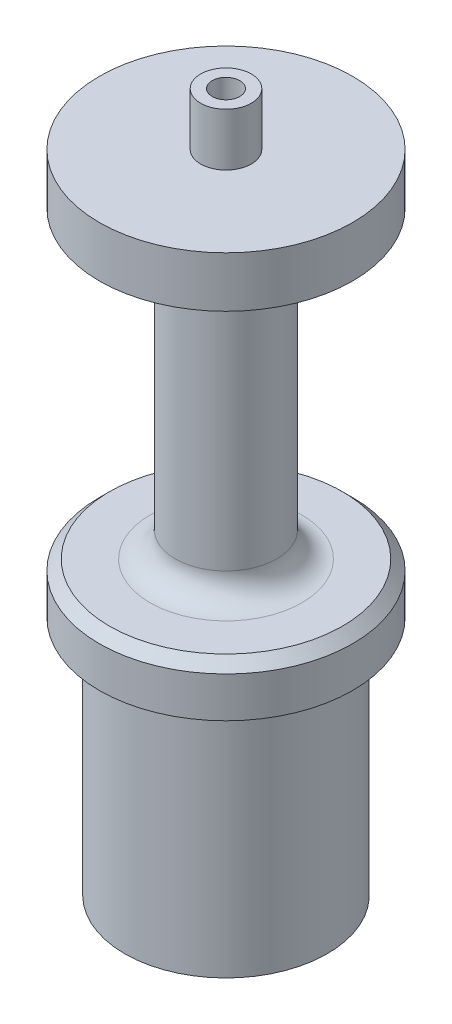
ISO-10303-21;
HEADER;
FILE_DESCRIPTION(('STEP AP214'),'2;1');
FILE_NAME('part.step','',(''),(''),'','','');
FILE_SCHEMA(('AUTOMOTIVE_DESIGN { 1 0 10303 214 1 1 1 1 }'));
ENDSEC;
DATA;
#1=APPLICATION_CONTEXT('core data for automotive mechanical design processes');
#2=APPLICATION_PROTOCOL_DEFINITION('international standard','automotive_design',2000,#1);
#3=PRODUCT_CONTEXT('',#1,'mechanical');
#4=PRODUCT('Part','Part','',(#3));
#5=PRODUCT_RELATED_PRODUCT_CATEGORY('part','',(#4));
#6=PRODUCT_DEFINITION_FORMATION('','',#4);
#7=PRODUCT_DEFINITION_CONTEXT('part definition',#1,'design');
#8=PRODUCT_DEFINITION('design','',#6,#7);
#9=PRODUCT_DEFINITION_SHAPE('','',#8);
#10=(LENGTH_UNIT() NAMED_UNIT(*) SI_UNIT(.MILLI.,.METRE.));
#11=(NAMED_UNIT(*) PLANE_ANGLE_UNIT() SI_UNIT($,.RADIAN.));
#12=(NAMED_UNIT(*) SI_UNIT($,.STERADIAN.) SOLID_ANGLE_UNIT());
#13=UNCERTAINTY_MEASURE_WITH_UNIT(LENGTH_MEASURE(1.E-05),#10,'distance_accuracy_value','');
#14=(GEOMETRIC_REPRESENTATION_CONTEXT(3) GLOBAL_UNCERTAINTY_ASSIGNED_CONTEXT((#13)) GLOBAL_UNIT_ASSIGNED_CONTEXT((#10,
#11,#12)) REPRESENTATION_CONTEXT('',''));
#15=CARTESIAN_POINT('',(0.,0.,0.));
#16=DIRECTION('',(0.,0.,1.));
#17=DIRECTION('',(1.,0.,0.));
#18=AXIS2_PLACEMENT_3D('',#15,#16,#17);
#19=CARTESIAN_POINT('',(0.,80.9625,0.));
#20=DIRECTION('',(0.,-1.,0.));
#21=DIRECTION('',(0.,0.,-1.));
#22=AXIS2_PLACEMENT_3D('',#19,#20,#21);
#23=CYLINDRICAL_SURFACE('',#22,15.875);
#24=CARTESIAN_POINT('',(0.,35.2425,0.));
#25=DIRECTION('',(0.,1.,0.));
#26=DIRECTION('',(0.,0.,1.));
#27=AXIS2_PLACEMENT_3D('',#24,#25,#26);
#28=CIRCLE('',#27,15.875);
#29=CARTESIAN_POINT('',(0.,35.2425,15.875));
#30=VERTEX_POINT('',#29);
#31=EDGE_CURVE('E11',#30,#30,#28,.F.);
#32=ORIENTED_EDGE('',*,*,#31,.T.);
#33=EDGE_LOOP('',(#32));
#34=FACE_BOUND('',#33,.T.);
#35=CARTESIAN_POINT('',(0.,30.1625,0.));
#36=DIRECTION('',(0.,1.,0.));
#37=DIRECTION('',(0.,0.,1.));
#38=AXIS2_PLACEMENT_3D('',#35,#36,#37);
#39=CIRCLE('',#38,15.875);
#40=CARTESIAN_POINT('',(0.,30.1625,15.875));
#41=VERTEX_POINT('',#40);
#42=EDGE_CURVE('E296',#41,#41,#39,.T.);
#43=ORIENTED_EDGE('',*,*,#42,.T.);
#44=EDGE_LOOP('',(#43));
#45=FACE_BOUND('',#44,.T.);
#46=ADVANCED_FACE('F34',(#34,#45),#23,.T.);
#47=CARTESIAN_POINT('',(0.,0.,0.));
#48=DIRECTION('',(0.,1.,0.));
#49=DIRECTION('',(0.,0.,1.));
#50=AXIS2_PLACEMENT_3D('',#47,#48,#49);
#51=PLANE('',#50);
#52=CARTESIAN_POINT('',(0.,0.,0.));
#53=DIRECTION('',(0.,1.,0.));
#54=DIRECTION('',(0.,0.,1.));
#55=AXIS2_PLACEMENT_3D('',#52,#53,#54);
#56=CIRCLE('',#55,12.7);
#57=CARTESIAN_POINT('',(0.,0.,12.7));
#58=VERTEX_POINT('',#57);
#59=EDGE_CURVE('E341',#58,#58,#56,.T.);
#60=ORIENTED_EDGE('',*,*,#59,.F.);
#61=EDGE_LOOP('',(#60));
#62=FACE_BOUND('',#61,.T.);
#63=DIRECTION('',(0.707106781186548,0.,0.707106781186547));
#64=VECTOR('',#63,1.);
#65=CARTESIAN_POINT('',(-4.94974746830584,0.,4.94974746830584));
#66=LINE('',#65,#64);
#67=CARTESIAN_POINT('',(-8.77696292147802,0.,1.12253201513365));
#68=VERTEX_POINT('',#67);
#69=CARTESIAN_POINT('',(-7.,0.,2.89949493661167));
#70=VERTEX_POINT('',#69);
#71=EDGE_CURVE('E49',#68,#70,#66,.T.);
#72=ORIENTED_EDGE('',*,*,#71,.T.);
#73=DIRECTION('',(0.,0.,1.));
#74=VECTOR('',#73,1.);
#75=CARTESIAN_POINT('',(-7.,0.,0.));
#76=LINE('',#75,#74);
#77=CARTESIAN_POINT('',(-7.,0.,5.4125));
#78=VERTEX_POINT('',#77);
#79=EDGE_CURVE('E135',#70,#78,#76,.T.);
#80=ORIENTED_EDGE('',*,*,#79,.T.);
#81=CARTESIAN_POINT('',(-5.4125,0.,5.4125));
#82=DIRECTION('',(0.,-1.,0.));
#83=DIRECTION('',(0.,0.,-1.));
#84=AXIS2_PLACEMENT_3D('',#81,#82,#83);
#85=CIRCLE('',#84,1.5875);
#86=CARTESIAN_POINT('',(-5.4125,0.,7.));
#87=VERTEX_POINT('',#86);
#88=EDGE_CURVE('E290',#87,#78,#85,.T.);
#89=ORIENTED_EDGE('',*,*,#88,.F.);
#90=DIRECTION('',(1.,0.,0.));
#91=VECTOR('',#90,1.);
#92=CARTESIAN_POINT('',(0.,0.,7.));
#93=LINE('',#92,#91);
#94=CARTESIAN_POINT('',(-2.89949493661167,0.,7.));
#95=VERTEX_POINT('',#94);
#96=EDGE_CURVE('E207',#87,#95,#93,.T.);
#97=ORIENTED_EDGE('',*,*,#96,.T.);
#98=DIRECTION('',(0.707106781186548,0.,0.707106781186547));
#99=VECTOR('',#98,1.);
#100=CARTESIAN_POINT('',(-4.94974746830584,0.,4.94974746830584));
#101=LINE('',#100,#99);
#102=CARTESIAN_POINT('',(-1.12253201513365,0.,8.77696292147802));
#103=VERTEX_POINT('',#102);
#104=EDGE_CURVE('E286',#95,#103,#101,.T.);
#105=ORIENTED_EDGE('',*,*,#104,.T.);
#106=CARTESIAN_POINT('',(0.,0.,7.65443090634438));
#107=DIRECTION('',(0.,-1.,0.));
#108=DIRECTION('',(0.,0.,-1.));
#109=AXIS2_PLACEMENT_3D('',#106,#107,#108);
#110=CIRCLE('',#109,1.5875);
#111=CARTESIAN_POINT('',(1.12253201513365,0.,8.77696292147801));
#112=VERTEX_POINT('',#111);
#113=EDGE_CURVE('E283',#112,#103,#110,.T.);
#114=ORIENTED_EDGE('',*,*,#113,.F.);
#115=DIRECTION('',(0.707106781186548,0.,-0.707106781186548));
#116=VECTOR('',#115,1.);
#117=CARTESIAN_POINT('',(4.94974746830583,0.,4.94974746830583));
#118=LINE('',#117,#116);
#119=CARTESIAN_POINT('',(2.89949493661166,0.,7.));
#120=VERTEX_POINT('',#119);
#121=EDGE_CURVE('E280',#112,#120,#118,.T.);
#122=ORIENTED_EDGE('',*,*,#121,.T.);
#123=DIRECTION('',(1.,0.,0.));
#124=VECTOR('',#123,1.);
#125=CARTESIAN_POINT('',(0.,0.,7.));
#126=LINE('',#125,#124);
#127=CARTESIAN_POINT('',(5.4125,0.,7.));
#128=VERTEX_POINT('',#127);
#129=EDGE_CURVE('E277',#120,#128,#126,.T.);
#130=ORIENTED_EDGE('',*,*,#129,.T.);
#131=CARTESIAN_POINT('',(5.4125,0.,5.4125));
#132=DIRECTION('',(0.,-1.,0.));
#133=DIRECTION('',(0.,0.,-1.));
#134=AXIS2_PLACEMENT_3D('',#131,#132,#133);
#135=CIRCLE('',#134,1.5875);
#136=CARTESIAN_POINT('',(7.,0.,5.4125));
#137=VERTEX_POINT('',#136);
#138=EDGE_CURVE('E274',#137,#128,#135,.T.);
#139=ORIENTED_EDGE('',*,*,#138,.F.);
#140=DIRECTION('',(0.,0.,1.));
#141=VECTOR('',#140,1.);
#142=CARTESIAN_POINT('',(7.,0.,0.));
#143=LINE('',#142,#141);
#144=CARTESIAN_POINT('',(7.,0.,2.89949493661167));
#145=VERTEX_POINT('',#144);
#146=EDGE_CURVE('E271',#145,#137,#143,.T.);
#147=ORIENTED_EDGE('',*,*,#146,.F.);
#148=DIRECTION('',(0.707106781186548,0.,-0.707106781186548));
#149=VECTOR('',#148,1.);
#150=CARTESIAN_POINT('',(4.94974746830583,0.,4.94974746830583));
#151=LINE('',#150,#149);
#152=CARTESIAN_POINT('',(8.77696292147802,0.,1.12253201513365));
#153=VERTEX_POINT('',#152);
#154=EDGE_CURVE('E268',#145,#153,#151,.T.);
#155=ORIENTED_EDGE('',*,*,#154,.T.);
#156=CARTESIAN_POINT('',(7.65443090634438,0.,0.));
#157=DIRECTION('',(0.,-1.,0.));
#158=DIRECTION('',(0.,0.,-1.));
#159=AXIS2_PLACEMENT_3D('',#156,#157,#158);
#160=CIRCLE('',#159,1.5875);
#161=CARTESIAN_POINT('',(8.77696292147801,0.,-1.12253201513364));
#162=VERTEX_POINT('',#161);
#163=EDGE_CURVE('E265',#162,#153,#160,.T.);
#164=ORIENTED_EDGE('',*,*,#163,.F.);
#165=DIRECTION('',(0.707106781186548,0.,0.707106781186548));
#166=VECTOR('',#165,1.);
#167=CARTESIAN_POINT('',(4.94974746830583,0.,-4.94974746830583));
#168=LINE('',#167,#166);
#169=CARTESIAN_POINT('',(7.,0.,-2.89949493661165));
#170=VERTEX_POINT('',#169);
#171=EDGE_CURVE('E262',#170,#162,#168,.T.);
#172=ORIENTED_EDGE('',*,*,#171,.F.);
#173=DIRECTION('',(0.,0.,1.));
#174=VECTOR('',#173,1.);
#175=CARTESIAN_POINT('',(7.,0.,0.));
#176=LINE('',#175,#174);
#177=CARTESIAN_POINT('',(7.,0.,-5.4125));
#178=VERTEX_POINT('',#177);
#179=EDGE_CURVE('E259',#178,#170,#176,.T.);
#180=ORIENTED_EDGE('',*,*,#179,.F.);
#181=CARTESIAN_POINT('',(5.4125,0.,-5.4125));
#182=DIRECTION('',(0.,-1.,0.));
#183=DIRECTION('',(0.,0.,-1.));
#184=AXIS2_PLACEMENT_3D('',#181,#182,#183);
#185=CIRCLE('',#184,1.5875);
#186=CARTESIAN_POINT('',(5.4125,0.,-7.));
#187=VERTEX_POINT('',#186);
#188=EDGE_CURVE('E256',#187,#178,#185,.T.);
#189=ORIENTED_EDGE('',*,*,#188,.F.);
#190=DIRECTION('',(1.,0.,0.));
#191=VECTOR('',#190,1.);
#192=CARTESIAN_POINT('',(0.,0.,-7.));
#193=LINE('',#192,#191);
#194=CARTESIAN_POINT('',(2.89949493661166,0.,-7.));
#195=VERTEX_POINT('',#194);
#196=EDGE_CURVE('E253',#195,#187,#193,.T.);
#197=ORIENTED_EDGE('',*,*,#196,.F.);
#198=DIRECTION('',(0.707106781186548,0.,0.707106781186548));
#199=VECTOR('',#198,1.);
#200=CARTESIAN_POINT('',(4.94974746830583,0.,-4.94974746830583));
#201=LINE('',#200,#199);
#202=CARTESIAN_POINT('',(1.12253201513364,0.,-8.77696292147802));
#203=VERTEX_POINT('',#202);
#204=EDGE_CURVE('E250',#203,#195,#201,.T.);
#205=ORIENTED_EDGE('',*,*,#204,.F.);
#206=CARTESIAN_POINT('',(0.,0.,-7.65443090634438));
#207=DIRECTION('',(0.,-1.,0.));
#208=DIRECTION('',(0.,0.,-1.));
#209=AXIS2_PLACEMENT_3D('',#206,#207,#208);
#210=CIRCLE('',#209,1.5875);
#211=CARTESIAN_POINT('',(-1.12253201513365,0.,-8.77696292147802));
#212=VERTEX_POINT('',#211);
#213=EDGE_CURVE('E247',#212,#203,#210,.T.);
#214=ORIENTED_EDGE('',*,*,#213,.F.);
#215=DIRECTION('',(0.707106781186547,0.,-0.707106781186548));
#216=VECTOR('',#215,1.);
#217=CARTESIAN_POINT('',(-4.94974746830583,0.,-4.94974746830583));
#218=LINE('',#217,#216);
#219=CARTESIAN_POINT('',(-2.89949493661167,0.,-7.));
#220=VERTEX_POINT('',#219);
#221=EDGE_CURVE('E244',#220,#212,#218,.T.);
#222=ORIENTED_EDGE('',*,*,#221,.F.);
#223=DIRECTION('',(1.,0.,0.));
#224=VECTOR('',#223,1.);
#225=CARTESIAN_POINT('',(0.,0.,-7.));
#226=LINE('',#225,#224);
#227=CARTESIAN_POINT('',(-5.4125,0.,-7.));
#228=VERTEX_POINT('',#227);
#229=EDGE_CURVE('E241',#228,#220,#226,.T.);
#230=ORIENTED_EDGE('',*,*,#229,.F.);
#231=CARTESIAN_POINT('',(-5.4125,0.,-5.4125));
#232=DIRECTION('',(0.,-1.,0.));
#233=DIRECTION('',(0.,0.,-1.));
#234=AXIS2_PLACEMENT_3D('',#231,#232,#233);
#235=CIRCLE('',#234,1.5875);
#236=CARTESIAN_POINT('',(-7.,0.,-5.4125));
#237=VERTEX_POINT('',#236);
#238=EDGE_CURVE('E238',#237,#228,#235,.T.);
#239=ORIENTED_EDGE('',*,*,#238,.F.);
#240=DIRECTION('',(0.,0.,1.));
#241=VECTOR('',#240,1.);
#242=CARTESIAN_POINT('',(-7.,0.,0.));
#243=LINE('',#242,#241);
#244=CARTESIAN_POINT('',(-7.,0.,-2.89949493661167));
#245=VERTEX_POINT('',#244);
#246=EDGE_CURVE('E235',#237,#245,#243,.T.);
#247=ORIENTED_EDGE('',*,*,#246,.T.);
#248=DIRECTION('',(0.707106781186547,0.,-0.707106781186548));
#249=VECTOR('',#248,1.);
#250=CARTESIAN_POINT('',(-4.94974746830583,0.,-4.94974746830583));
#251=LINE('',#250,#249);
#252=CARTESIAN_POINT('',(-8.77696292147803,0.,-1.12253201513364));
#253=VERTEX_POINT('',#252);
#254=EDGE_CURVE('E232',#253,#245,#251,.T.);
#255=ORIENTED_EDGE('',*,*,#254,.F.);
#256=CARTESIAN_POINT('',(-7.65443090634438,0.,0.));
#257=DIRECTION('',(0.,-1.,0.));
#258=DIRECTION('',(0.,0.,-1.));
#259=AXIS2_PLACEMENT_3D('',#256,#257,#258);
#260=CIRCLE('',#259,1.5875);
#261=EDGE_CURVE('E228',#68,#253,#260,.T.);
#262=ORIENTED_EDGE('',*,*,#261,.F.);
#263=EDGE_LOOP('',(#72,#80,#89,#97,#105,#114,#122,#130,#139,#147,#155,#164,#172,#180,#189,#197,
#205,#214,#222,#230,#239,#247,#255,#262));
#264=FACE_BOUND('',#263,.T.);
#265=ADVANCED_FACE('F377',(#62,#264),#51,.F.);
#266=CARTESIAN_POINT('',(0.,30.1625,0.));
#267=DIRECTION('',(0.,-1.,0.));
#268=DIRECTION('',(0.,0.,-1.));
#269=AXIS2_PLACEMENT_3D('',#266,#267,#268);
#270=CYLINDRICAL_SURFACE('',#269,12.7);
#271=CARTESIAN_POINT('',(0.,30.1625,0.));
#272=DIRECTION('',(0.,1.,0.));
#273=DIRECTION('',(0.,0.,1.));
#274=AXIS2_PLACEMENT_3D('',#271,#272,#273);
#275=CIRCLE('',#274,12.7);
#276=CARTESIAN_POINT('',(0.,30.1625,12.7));
#277=VERTEX_POINT('',#276);
#278=EDGE_CURVE('E344',#277,#277,#275,.T.);
#279=ORIENTED_EDGE('',*,*,#278,.F.);
#280=EDGE_LOOP('',(#279));
#281=FACE_BOUND('',#280,.T.);
#282=ORIENTED_EDGE('',*,*,#59,.T.);
#283=EDGE_LOOP('',(#282));
#284=FACE_BOUND('',#283,.T.);
#285=ADVANCED_FACE('F384',(#281,#284),#270,.T.);
#286=CARTESIAN_POINT('',(0.,74.6125,0.));
#287=DIRECTION('',(0.,1.,0.));
#288=DIRECTION('',(0.,0.,1.));
#289=AXIS2_PLACEMENT_3D('',#286,#287,#288);
#290=CIRCLE('',#289,15.875);
#291=CARTESIAN_POINT('',(0.,74.6125,15.875));
#292=VERTEX_POINT('',#291);
#293=EDGE_CURVE('E404',#292,#292,#290,.T.);
#294=ORIENTED_EDGE('',*,*,#293,.T.);
#295=EDGE_LOOP('',(#294));
#296=FACE_BOUND('',#295,.T.);
#297=CARTESIAN_POINT('',(0.,80.9625,0.));
#298=DIRECTION('',(0.,1.,0.));
#299=DIRECTION('',(0.,0.,1.));
#300=AXIS2_PLACEMENT_3D('',#297,#298,#299);
#301=CIRCLE('',#300,15.875);
#302=CARTESIAN_POINT('',(0.,80.9625,15.875));
#303=VERTEX_POINT('',#302);
#304=EDGE_CURVE('E338',#303,#303,#301,.T.);
#305=ORIENTED_EDGE('',*,*,#304,.F.);
#306=EDGE_LOOP('',(#305));
#307=FACE_BOUND('',#306,.T.);
#308=ADVANCED_FACE('F380',(#296,#307),#23,.T.);
#309=CARTESIAN_POINT('',(0.,80.9625,0.));
#310=DIRECTION('',(0.,1.,0.));
#311=DIRECTION('',(0.,0.,1.));
#312=AXIS2_PLACEMENT_3D('',#309,#310,#311);
#313=PLANE('',#312);
#314=CARTESIAN_POINT('',(0.,80.9625,0.));
#315=DIRECTION('',(0.,1.,0.));
#316=DIRECTION('',(0.,0.,1.));
#317=AXIS2_PLACEMENT_3D('',#314,#315,#316);
#318=CIRCLE('',#317,3.175);
#319=CARTESIAN_POINT('',(0.,80.9625,3.175));
#320=VERTEX_POINT('',#319);
#321=EDGE_CURVE('E347',#320,#320,#318,.T.);
#322=ORIENTED_EDGE('',*,*,#321,.F.);
#323=EDGE_LOOP('',(#322));
#324=FACE_BOUND('',#323,.T.);
#325=ORIENTED_EDGE('',*,*,#304,.T.);
#326=EDGE_LOOP('',(#325));
#327=FACE_BOUND('',#326,.T.);
#328=ADVANCED_FACE('F390',(#324,#327),#313,.T.);
#329=CARTESIAN_POINT('',(0.,30.1625,0.));
#330=DIRECTION('',(0.,1.,0.));
#331=DIRECTION('',(0.,0.,1.));
#332=AXIS2_PLACEMENT_3D('',#329,#330,#331);
#333=PLANE('',#332);
#334=ORIENTED_EDGE('',*,*,#278,.T.);
#335=EDGE_LOOP('',(#334));
#336=FACE_BOUND('',#335,.T.);
#337=ORIENTED_EDGE('',*,*,#42,.F.);
#338=EDGE_LOOP('',(#337));
#339=FACE_BOUND('',#338,.T.);
#340=ADVANCED_FACE('F396',(#336,#339),#333,.F.);
#341=CARTESIAN_POINT('',(-4.94974746830584,11.176,4.94974746830584));
#342=DIRECTION('',(0.707106781186548,0.,-0.707106781186548));
#343=DIRECTION('',(-0.707106781186548,0.,-0.707106781186547));
#344=AXIS2_PLACEMENT_3D('',#341,#342,#343);
#345=PLANE('',#344);
#346=ORIENTED_EDGE('',*,*,#71,.F.);
#347=DIRECTION('',(0.,-1.,0.));
#348=VECTOR('',#347,1.);
#349=CARTESIAN_POINT('',(-8.77696292147802,11.176,1.12253201513365));
#350=LINE('',#349,#348);
#351=CARTESIAN_POINT('',(-8.77696292147802,11.176,1.12253201513365));
#352=VERTEX_POINT('',#351);
#353=EDGE_CURVE('E138',#352,#68,#350,.T.);
#354=ORIENTED_EDGE('',*,*,#353,.F.);
#355=DIRECTION('',(0.707106781186548,0.,0.707106781186547));
#356=VECTOR('',#355,1.);
#357=CARTESIAN_POINT('',(-4.94974746830584,11.176,4.94974746830584));
#358=LINE('',#357,#356);
#359=CARTESIAN_POINT('',(-7.,11.176,2.89949493661167));
#360=VERTEX_POINT('',#359);
#361=EDGE_CURVE('E293',#352,#360,#358,.T.);
#362=ORIENTED_EDGE('',*,*,#361,.T.);
#363=DIRECTION('',(0.,-1.,0.));
#364=VECTOR('',#363,1.);
#365=CARTESIAN_POINT('',(-7.,11.176,2.89949493661167));
#366=LINE('',#365,#364);
#367=EDGE_CURVE('E294',#360,#70,#366,.T.);
#368=ORIENTED_EDGE('',*,*,#367,.T.);
#369=EDGE_LOOP('',(#346,#354,#362,#368));
#370=FACE_BOUND('',#369,.T.);
#371=ADVANCED_FACE('F505',(#370),#345,.T.);
#372=CARTESIAN_POINT('',(-7.,11.176,0.));
#373=DIRECTION('',(1.,0.,0.));
#374=DIRECTION('',(0.,0.,-1.));
#375=AXIS2_PLACEMENT_3D('',#372,#373,#374);
#376=PLANE('',#375);
#377=ORIENTED_EDGE('',*,*,#79,.F.);
#378=ORIENTED_EDGE('',*,*,#367,.F.);
#379=DIRECTION('',(0.,0.,1.));
#380=VECTOR('',#379,1.);
#381=CARTESIAN_POINT('',(-7.,11.176,0.));
#382=LINE('',#381,#380);
#383=CARTESIAN_POINT('',(-7.,11.176,5.4125));
#384=VERTEX_POINT('',#383);
#385=EDGE_CURVE('E58',#360,#384,#382,.T.);
#386=ORIENTED_EDGE('',*,*,#385,.T.);
#387=DIRECTION('',(0.,-1.,0.));
#388=VECTOR('',#387,1.);
#389=CARTESIAN_POINT('',(-7.,11.176,5.4125));
#390=LINE('',#389,#388);
#391=EDGE_CURVE('E212',#384,#78,#390,.T.);
#392=ORIENTED_EDGE('',*,*,#391,.T.);
#393=EDGE_LOOP('',(#377,#378,#386,#392));
#394=FACE_BOUND('',#393,.T.);
#395=ADVANCED_FACE('F506',(#394),#376,.T.);
#396=CARTESIAN_POINT('',(-5.4125,11.176,5.4125));
#397=DIRECTION('',(0.,-1.,0.));
#398=DIRECTION('',(0.,0.,-1.));
#399=AXIS2_PLACEMENT_3D('',#396,#397,#398);
#400=CYLINDRICAL_SURFACE('',#399,1.5875);
#401=ORIENTED_EDGE('',*,*,#88,.T.);
#402=ORIENTED_EDGE('',*,*,#391,.F.);
#403=CARTESIAN_POINT('',(-5.4125,11.176,5.4125));
#404=DIRECTION('',(0.,-1.,0.));
#405=DIRECTION('',(0.,0.,-1.));
#406=AXIS2_PLACEMENT_3D('',#403,#404,#405);
#407=CIRCLE('',#406,1.5875);
#408=CARTESIAN_POINT('',(-5.4125,11.176,7.));
#409=VERTEX_POINT('',#408);
#410=EDGE_CURVE('E217',#409,#384,#407,.T.);
#411=ORIENTED_EDGE('',*,*,#410,.F.);
#412=DIRECTION('',(0.,-1.,0.));
#413=VECTOR('',#412,1.);
#414=CARTESIAN_POINT('',(-5.4125,11.176,7.));
#415=LINE('',#414,#413);
#416=EDGE_CURVE('E201',#409,#87,#415,.T.);
#417=ORIENTED_EDGE('',*,*,#416,.T.);
#418=EDGE_LOOP('',(#401,#402,#411,#417));
#419=FACE_BOUND('',#418,.T.);
#420=ADVANCED_FACE('F222',(#419),#400,.F.);
#421=CARTESIAN_POINT('',(0.,11.176,7.));
#422=DIRECTION('',(0.,0.,-1.));
#423=DIRECTION('',(-1.,0.,0.));
#424=AXIS2_PLACEMENT_3D('',#421,#422,#423);
#425=PLANE('',#424);
#426=ORIENTED_EDGE('',*,*,#96,.F.);
#427=ORIENTED_EDGE('',*,*,#416,.F.);
#428=DIRECTION('',(1.,0.,0.));
#429=VECTOR('',#428,1.);
#430=CARTESIAN_POINT('',(0.,11.176,7.));
#431=LINE('',#430,#429);
#432=CARTESIAN_POINT('',(-2.89949493661167,11.176,7.));
#433=VERTEX_POINT('',#432);
#434=EDGE_CURVE('E204',#409,#433,#431,.T.);
#435=ORIENTED_EDGE('',*,*,#434,.T.);
#436=DIRECTION('',(0.,-1.,0.));
#437=VECTOR('',#436,1.);
#438=CARTESIAN_POINT('',(-2.89949493661167,11.176,7.));
#439=LINE('',#438,#437);
#440=EDGE_CURVE('E213',#433,#95,#439,.T.);
#441=ORIENTED_EDGE('',*,*,#440,.T.);
#442=EDGE_LOOP('',(#426,#427,#435,#441));
#443=FACE_BOUND('',#442,.T.);
#444=ADVANCED_FACE('F203',(#443),#425,.T.);
#445=CARTESIAN_POINT('',(-4.94974746830584,11.176,4.94974746830584));
#446=DIRECTION('',(0.707106781186548,0.,-0.707106781186548));
#447=DIRECTION('',(-0.707106781186548,0.,-0.707106781186547));
#448=AXIS2_PLACEMENT_3D('',#445,#446,#447);
#449=PLANE('',#448);
#450=ORIENTED_EDGE('',*,*,#104,.F.);
#451=ORIENTED_EDGE('',*,*,#440,.F.);
#452=DIRECTION('',(0.707106781186548,0.,0.707106781186547));
#453=VECTOR('',#452,1.);
#454=CARTESIAN_POINT('',(-4.94974746830584,11.176,4.94974746830584));
#455=LINE('',#454,#453);
#456=CARTESIAN_POINT('',(-1.12253201513365,11.176,8.77696292147802));
#457=VERTEX_POINT('',#456);
#458=EDGE_CURVE('E219',#433,#457,#455,.T.);
#459=ORIENTED_EDGE('',*,*,#458,.T.);
#460=DIRECTION('',(0.,-1.,0.));
#461=VECTOR('',#460,1.);
#462=CARTESIAN_POINT('',(-1.12253201513365,11.176,8.77696292147802));
#463=LINE('',#462,#461);
#464=EDGE_CURVE('E299',#457,#103,#463,.T.);
#465=ORIENTED_EDGE('',*,*,#464,.T.);
#466=EDGE_LOOP('',(#450,#451,#459,#465));
#467=FACE_BOUND('',#466,.T.);
#468=ADVANCED_FACE('F481',(#467),#449,.T.);
#469=CARTESIAN_POINT('',(0.,11.176,7.65443090634438));
#470=DIRECTION('',(0.,-1.,0.));
#471=DIRECTION('',(0.,0.,-1.));
#472=AXIS2_PLACEMENT_3D('',#469,#470,#471);
#473=CYLINDRICAL_SURFACE('',#472,1.5875);
#474=ORIENTED_EDGE('',*,*,#113,.T.);
#475=ORIENTED_EDGE('',*,*,#464,.F.);
#476=CARTESIAN_POINT('',(0.,11.176,7.65443090634438));
#477=DIRECTION('',(0.,-1.,0.));
#478=DIRECTION('',(0.,0.,-1.));
#479=AXIS2_PLACEMENT_3D('',#476,#477,#478);
#480=CIRCLE('',#479,1.5875);
#481=CARTESIAN_POINT('',(1.12253201513365,11.176,8.77696292147801));
#482=VERTEX_POINT('',#481);
#483=EDGE_CURVE('E477',#482,#457,#480,.T.);
#484=ORIENTED_EDGE('',*,*,#483,.F.);
#485=DIRECTION('',(0.,-1.,0.));
#486=VECTOR('',#485,1.);
#487=CARTESIAN_POINT('',(1.12253201513365,11.176,8.77696292147801));
#488=LINE('',#487,#486);
#489=EDGE_CURVE('E301',#482,#112,#488,.T.);
#490=ORIENTED_EDGE('',*,*,#489,.T.);
#491=EDGE_LOOP('',(#474,#475,#484,#490));
#492=FACE_BOUND('',#491,.T.);
#493=ADVANCED_FACE('F484',(#492),#473,.F.);
#494=CARTESIAN_POINT('',(4.94974746830583,11.176,4.94974746830583));
#495=DIRECTION('',(-0.707106781186548,0.,-0.707106781186548));
#496=DIRECTION('',(-0.707106781186548,0.,0.707106781186548));
#497=AXIS2_PLACEMENT_3D('',#494,#495,#496);
#498=PLANE('',#497);
#499=ORIENTED_EDGE('',*,*,#121,.F.);
#500=ORIENTED_EDGE('',*,*,#489,.F.);
#501=DIRECTION('',(0.707106781186548,0.,-0.707106781186548));
#502=VECTOR('',#501,1.);
#503=CARTESIAN_POINT('',(4.94974746830583,11.176,4.94974746830583));
#504=LINE('',#503,#502);
#505=CARTESIAN_POINT('',(2.89949493661166,11.176,7.));
#506=VERTEX_POINT('',#505);
#507=EDGE_CURVE('E475',#482,#506,#504,.T.);
#508=ORIENTED_EDGE('',*,*,#507,.T.);
#509=DIRECTION('',(0.,-1.,0.));
#510=VECTOR('',#509,1.);
#511=CARTESIAN_POINT('',(2.89949493661166,11.176,7.));
#512=LINE('',#511,#510);
#513=EDGE_CURVE('E303',#506,#120,#512,.T.);
#514=ORIENTED_EDGE('',*,*,#513,.T.);
#515=EDGE_LOOP('',(#499,#500,#508,#514));
#516=FACE_BOUND('',#515,.T.);
#517=ADVANCED_FACE('F491',(#516),#498,.T.);
#518=CARTESIAN_POINT('',(0.,11.176,7.));
#519=DIRECTION('',(0.,0.,-1.));
#520=DIRECTION('',(-1.,0.,0.));
#521=AXIS2_PLACEMENT_3D('',#518,#519,#520);
#522=PLANE('',#521);
#523=ORIENTED_EDGE('',*,*,#129,.F.);
#524=ORIENTED_EDGE('',*,*,#513,.F.);
#525=DIRECTION('',(1.,0.,0.));
#526=VECTOR('',#525,1.);
#527=CARTESIAN_POINT('',(0.,11.176,7.));
#528=LINE('',#527,#526);
#529=CARTESIAN_POINT('',(5.4125,11.176,7.));
#530=VERTEX_POINT('',#529);
#531=EDGE_CURVE('E473',#506,#530,#528,.T.);
#532=ORIENTED_EDGE('',*,*,#531,.T.);
#533=DIRECTION('',(0.,-1.,0.));
#534=VECTOR('',#533,1.);
#535=CARTESIAN_POINT('',(5.4125,11.176,7.));
#536=LINE('',#535,#534);
#537=EDGE_CURVE('E305',#530,#128,#536,.T.);
#538=ORIENTED_EDGE('',*,*,#537,.T.);
#539=EDGE_LOOP('',(#523,#524,#532,#538));
#540=FACE_BOUND('',#539,.T.);
#541=ADVANCED_FACE('F494',(#540),#522,.T.);
#542=CARTESIAN_POINT('',(5.4125,11.176,5.4125));
#543=DIRECTION('',(0.,-1.,0.));
#544=DIRECTION('',(0.,0.,-1.));
#545=AXIS2_PLACEMENT_3D('',#542,#543,#544);
#546=CYLINDRICAL_SURFACE('',#545,1.5875);
#547=ORIENTED_EDGE('',*,*,#138,.T.);
#548=ORIENTED_EDGE('',*,*,#537,.F.);
#549=CARTESIAN_POINT('',(5.4125,11.176,5.4125));
#550=DIRECTION('',(0.,-1.,0.));
#551=DIRECTION('',(0.,0.,-1.));
#552=AXIS2_PLACEMENT_3D('',#549,#550,#551);
#553=CIRCLE('',#552,1.5875);
#554=CARTESIAN_POINT('',(7.,11.176,5.4125));
#555=VERTEX_POINT('',#554);
#556=EDGE_CURVE('E470',#555,#530,#553,.T.);
#557=ORIENTED_EDGE('',*,*,#556,.F.);
#558=DIRECTION('',(0.,-1.,0.));
#559=VECTOR('',#558,1.);
#560=CARTESIAN_POINT('',(7.,11.176,5.4125));
#561=LINE('',#560,#559);
#562=EDGE_CURVE('E307',#555,#137,#561,.T.);
#563=ORIENTED_EDGE('',*,*,#562,.T.);
#564=EDGE_LOOP('',(#547,#548,#557,#563));
#565=FACE_BOUND('',#564,.T.);
#566=ADVANCED_FACE('F528',(#565),#546,.F.);
#567=CARTESIAN_POINT('',(7.,11.176,0.));
#568=DIRECTION('',(1.,0.,0.));
#569=DIRECTION('',(0.,0.,-1.));
#570=AXIS2_PLACEMENT_3D('',#567,#568,#569);
#571=PLANE('',#570);
#572=ORIENTED_EDGE('',*,*,#146,.T.);
#573=ORIENTED_EDGE('',*,*,#562,.F.);
#574=DIRECTION('',(0.,0.,1.));
#575=VECTOR('',#574,1.);
#576=CARTESIAN_POINT('',(7.,11.176,0.));
#577=LINE('',#576,#575);
#578=CARTESIAN_POINT('',(7.,11.176,2.89949493661167));
#579=VERTEX_POINT('',#578);
#580=EDGE_CURVE('E467',#579,#555,#577,.T.);
#581=ORIENTED_EDGE('',*,*,#580,.F.);
#582=DIRECTION('',(0.,-1.,0.));
#583=VECTOR('',#582,1.);
#584=CARTESIAN_POINT('',(7.,11.176,2.89949493661167));
#585=LINE('',#584,#583);
#586=EDGE_CURVE('E309',#579,#145,#585,.T.);
#587=ORIENTED_EDGE('',*,*,#586,.T.);
#588=EDGE_LOOP('',(#572,#573,#581,#587));
#589=FACE_BOUND('',#588,.T.);
#590=ADVANCED_FACE('F531',(#589),#571,.F.);
#591=CARTESIAN_POINT('',(4.94974746830583,11.176,4.94974746830583));
#592=DIRECTION('',(-0.707106781186548,0.,-0.707106781186548));
#593=DIRECTION('',(-0.707106781186548,0.,0.707106781186548));
#594=AXIS2_PLACEMENT_3D('',#591,#592,#593);
#595=PLANE('',#594);
#596=ORIENTED_EDGE('',*,*,#154,.F.);
#597=ORIENTED_EDGE('',*,*,#586,.F.);
#598=DIRECTION('',(0.707106781186548,0.,-0.707106781186548));
#599=VECTOR('',#598,1.);
#600=CARTESIAN_POINT('',(4.94974746830583,11.176,4.94974746830583));
#601=LINE('',#600,#599);
#602=CARTESIAN_POINT('',(8.77696292147802,11.176,1.12253201513365));
#603=VERTEX_POINT('',#602);
#604=EDGE_CURVE('E465',#579,#603,#601,.T.);
#605=ORIENTED_EDGE('',*,*,#604,.T.);
#606=DIRECTION('',(0.,-1.,0.));
#607=VECTOR('',#606,1.);
#608=CARTESIAN_POINT('',(8.77696292147802,11.176,1.12253201513365));
#609=LINE('',#608,#607);
#610=EDGE_CURVE('E311',#603,#153,#609,.T.);
#611=ORIENTED_EDGE('',*,*,#610,.T.);
#612=EDGE_LOOP('',(#596,#597,#605,#611));
#613=FACE_BOUND('',#612,.T.);
#614=ADVANCED_FACE('F535',(#613),#595,.T.);
#615=CARTESIAN_POINT('',(7.65443090634438,11.176,0.));
#616=DIRECTION('',(0.,-1.,0.));
#617=DIRECTION('',(0.,0.,-1.));
#618=AXIS2_PLACEMENT_3D('',#615,#616,#617);
#619=CYLINDRICAL_SURFACE('',#618,1.5875);
#620=ORIENTED_EDGE('',*,*,#163,.T.);
#621=ORIENTED_EDGE('',*,*,#610,.F.);
#622=CARTESIAN_POINT('',(7.65443090634438,11.176,0.));
#623=DIRECTION('',(0.,-1.,0.));
#624=DIRECTION('',(0.,0.,-1.));
#625=AXIS2_PLACEMENT_3D('',#622,#623,#624);
#626=CIRCLE('',#625,1.5875);
#627=CARTESIAN_POINT('',(8.77696292147801,11.176,-1.12253201513364));
#628=VERTEX_POINT('',#627);
#629=EDGE_CURVE('E462',#628,#603,#626,.T.);
#630=ORIENTED_EDGE('',*,*,#629,.F.);
#631=DIRECTION('',(0.,-1.,0.));
#632=VECTOR('',#631,1.);
#633=CARTESIAN_POINT('',(8.77696292147801,11.176,-1.12253201513364));
#634=LINE('',#633,#632);
#635=EDGE_CURVE('E313',#628,#162,#634,.T.);
#636=ORIENTED_EDGE('',*,*,#635,.T.);
#637=EDGE_LOOP('',(#620,#621,#630,#636));
#638=FACE_BOUND('',#637,.T.);
#639=ADVANCED_FACE('F539',(#638),#619,.F.);
#640=CARTESIAN_POINT('',(4.94974746830583,11.176,-4.94974746830583));
#641=DIRECTION('',(0.707106781186548,0.,-0.707106781186548));
#642=DIRECTION('',(-0.707106781186548,0.,-0.707106781186548));
#643=AXIS2_PLACEMENT_3D('',#640,#641,#642);
#644=PLANE('',#643);
#645=ORIENTED_EDGE('',*,*,#171,.T.);
#646=ORIENTED_EDGE('',*,*,#635,.F.);
#647=DIRECTION('',(0.707106781186548,0.,0.707106781186548));
#648=VECTOR('',#647,1.);
#649=CARTESIAN_POINT('',(4.94974746830583,11.176,-4.94974746830583));
#650=LINE('',#649,#648);
#651=CARTESIAN_POINT('',(7.,11.176,-2.89949493661165));
#652=VERTEX_POINT('',#651);
#653=EDGE_CURVE('E459',#652,#628,#650,.T.);
#654=ORIENTED_EDGE('',*,*,#653,.F.);
#655=DIRECTION('',(0.,-1.,0.));
#656=VECTOR('',#655,1.);
#657=CARTESIAN_POINT('',(7.,11.176,-2.89949493661165));
#658=LINE('',#657,#656);
#659=EDGE_CURVE('E315',#652,#170,#658,.T.);
#660=ORIENTED_EDGE('',*,*,#659,.T.);
#661=EDGE_LOOP('',(#645,#646,#654,#660));
#662=FACE_BOUND('',#661,.T.);
#663=ADVANCED_FACE('F543',(#662),#644,.F.);
#664=CARTESIAN_POINT('',(7.,11.176,0.));
#665=DIRECTION('',(1.,0.,0.));
#666=DIRECTION('',(0.,0.,-1.));
#667=AXIS2_PLACEMENT_3D('',#664,#665,#666);
#668=PLANE('',#667);
#669=ORIENTED_EDGE('',*,*,#179,.T.);
#670=ORIENTED_EDGE('',*,*,#659,.F.);
#671=DIRECTION('',(0.,0.,1.));
#672=VECTOR('',#671,1.);
#673=CARTESIAN_POINT('',(7.,11.176,0.));
#674=LINE('',#673,#672);
#675=CARTESIAN_POINT('',(7.,11.176,-5.4125));
#676=VERTEX_POINT('',#675);
#677=EDGE_CURVE('E456',#676,#652,#674,.T.);
#678=ORIENTED_EDGE('',*,*,#677,.F.);
#679=DIRECTION('',(0.,-1.,0.));
#680=VECTOR('',#679,1.);
#681=CARTESIAN_POINT('',(7.,11.176,-5.4125));
#682=LINE('',#681,#680);
#683=EDGE_CURVE('E317',#676,#178,#682,.T.);
#684=ORIENTED_EDGE('',*,*,#683,.T.);
#685=EDGE_LOOP('',(#669,#670,#678,#684));
#686=FACE_BOUND('',#685,.T.);
#687=ADVANCED_FACE('F547',(#686),#668,.F.);
#688=CARTESIAN_POINT('',(5.4125,11.176,-5.4125));
#689=DIRECTION('',(0.,-1.,0.));
#690=DIRECTION('',(0.,0.,-1.));
#691=AXIS2_PLACEMENT_3D('',#688,#689,#690);
#692=CYLINDRICAL_SURFACE('',#691,1.5875);
#693=ORIENTED_EDGE('',*,*,#188,.T.);
#694=ORIENTED_EDGE('',*,*,#683,.F.);
#695=CARTESIAN_POINT('',(5.4125,11.176,-5.4125));
#696=DIRECTION('',(0.,-1.,0.));
#697=DIRECTION('',(0.,0.,-1.));
#698=AXIS2_PLACEMENT_3D('',#695,#696,#697);
#699=CIRCLE('',#698,1.5875);
#700=CARTESIAN_POINT('',(5.4125,11.176,-7.));
#701=VERTEX_POINT('',#700);
#702=EDGE_CURVE('E453',#701,#676,#699,.T.);
#703=ORIENTED_EDGE('',*,*,#702,.F.);
#704=DIRECTION('',(0.,-1.,0.));
#705=VECTOR('',#704,1.);
#706=CARTESIAN_POINT('',(5.4125,11.176,-7.));
#707=LINE('',#706,#705);
#708=EDGE_CURVE('E319',#701,#187,#707,.T.);
#709=ORIENTED_EDGE('',*,*,#708,.T.);
#710=EDGE_LOOP('',(#693,#694,#703,#709));
#711=FACE_BOUND('',#710,.T.);
#712=ADVANCED_FACE('F551',(#711),#692,.F.);
#713=CARTESIAN_POINT('',(0.,11.176,-7.));
#714=DIRECTION('',(0.,0.,-1.));
#715=DIRECTION('',(-1.,0.,0.));
#716=AXIS2_PLACEMENT_3D('',#713,#714,#715);
#717=PLANE('',#716);
#718=ORIENTED_EDGE('',*,*,#196,.T.);
#719=ORIENTED_EDGE('',*,*,#708,.F.);
#720=DIRECTION('',(1.,0.,0.));
#721=VECTOR('',#720,1.);
#722=CARTESIAN_POINT('',(0.,11.176,-7.));
#723=LINE('',#722,#721);
#724=CARTESIAN_POINT('',(2.89949493661166,11.176,-7.));
#725=VERTEX_POINT('',#724);
#726=EDGE_CURVE('E450',#725,#701,#723,.T.);
#727=ORIENTED_EDGE('',*,*,#726,.F.);
#728=DIRECTION('',(0.,-1.,0.));
#729=VECTOR('',#728,1.);
#730=CARTESIAN_POINT('',(2.89949493661166,11.176,-7.));
#731=LINE('',#730,#729);
#732=EDGE_CURVE('E321',#725,#195,#731,.T.);
#733=ORIENTED_EDGE('',*,*,#732,.T.);
#734=EDGE_LOOP('',(#718,#719,#727,#733));
#735=FACE_BOUND('',#734,.T.);
#736=ADVANCED_FACE('F555',(#735),#717,.F.);
#737=CARTESIAN_POINT('',(4.94974746830583,11.176,-4.94974746830583));
#738=DIRECTION('',(0.707106781186548,0.,-0.707106781186548));
#739=DIRECTION('',(-0.707106781186548,0.,-0.707106781186548));
#740=AXIS2_PLACEMENT_3D('',#737,#738,#739);
#741=PLANE('',#740);
#742=ORIENTED_EDGE('',*,*,#204,.T.);
#743=ORIENTED_EDGE('',*,*,#732,.F.);
#744=DIRECTION('',(0.707106781186548,0.,0.707106781186548));
#745=VECTOR('',#744,1.);
#746=CARTESIAN_POINT('',(4.94974746830583,11.176,-4.94974746830583));
#747=LINE('',#746,#745);
#748=CARTESIAN_POINT('',(1.12253201513364,11.176,-8.77696292147802));
#749=VERTEX_POINT('',#748);
#750=EDGE_CURVE('E447',#749,#725,#747,.T.);
#751=ORIENTED_EDGE('',*,*,#750,.F.);
#752=DIRECTION('',(0.,-1.,0.));
#753=VECTOR('',#752,1.);
#754=CARTESIAN_POINT('',(1.12253201513364,11.176,-8.77696292147802));
#755=LINE('',#754,#753);
#756=EDGE_CURVE('E323',#749,#203,#755,.T.);
#757=ORIENTED_EDGE('',*,*,#756,.T.);
#758=EDGE_LOOP('',(#742,#743,#751,#757));
#759=FACE_BOUND('',#758,.T.);
#760=ADVANCED_FACE('F559',(#759),#741,.F.);
#761=CARTESIAN_POINT('',(0.,11.176,-7.65443090634438));
#762=DIRECTION('',(0.,-1.,0.));
#763=DIRECTION('',(0.,0.,-1.));
#764=AXIS2_PLACEMENT_3D('',#761,#762,#763);
#765=CYLINDRICAL_SURFACE('',#764,1.5875);
#766=ORIENTED_EDGE('',*,*,#213,.T.);
#767=ORIENTED_EDGE('',*,*,#756,.F.);
#768=CARTESIAN_POINT('',(0.,11.176,-7.65443090634438));
#769=DIRECTION('',(0.,-1.,0.));
#770=DIRECTION('',(0.,0.,-1.));
#771=AXIS2_PLACEMENT_3D('',#768,#769,#770);
#772=CIRCLE('',#771,1.5875);
#773=CARTESIAN_POINT('',(-1.12253201513365,11.176,-8.77696292147802));
#774=VERTEX_POINT('',#773);
#775=EDGE_CURVE('E444',#774,#749,#772,.T.);
#776=ORIENTED_EDGE('',*,*,#775,.F.);
#777=DIRECTION('',(0.,-1.,0.));
#778=VECTOR('',#777,1.);
#779=CARTESIAN_POINT('',(-1.12253201513365,11.176,-8.77696292147802));
#780=LINE('',#779,#778);
#781=EDGE_CURVE('E325',#774,#212,#780,.T.);
#782=ORIENTED_EDGE('',*,*,#781,.T.);
#783=EDGE_LOOP('',(#766,#767,#776,#782));
#784=FACE_BOUND('',#783,.T.);
#785=ADVANCED_FACE('F563',(#784),#765,.F.);
#786=CARTESIAN_POINT('',(-4.94974746830583,11.176,-4.94974746830583));
#787=DIRECTION('',(-0.707106781186548,0.,-0.707106781186548));
#788=DIRECTION('',(-0.707106781186547,0.,0.707106781186548));
#789=AXIS2_PLACEMENT_3D('',#786,#787,#788);
#790=PLANE('',#789);
#791=ORIENTED_EDGE('',*,*,#221,.T.);
#792=ORIENTED_EDGE('',*,*,#781,.F.);
#793=DIRECTION('',(0.707106781186547,0.,-0.707106781186548));
#794=VECTOR('',#793,1.);
#795=CARTESIAN_POINT('',(-4.94974746830583,11.176,-4.94974746830583));
#796=LINE('',#795,#794);
#797=CARTESIAN_POINT('',(-2.89949493661167,11.176,-7.));
#798=VERTEX_POINT('',#797);
#799=EDGE_CURVE('E441',#798,#774,#796,.T.);
#800=ORIENTED_EDGE('',*,*,#799,.F.);
#801=DIRECTION('',(0.,-1.,0.));
#802=VECTOR('',#801,1.);
#803=CARTESIAN_POINT('',(-2.89949493661167,11.176,-7.));
#804=LINE('',#803,#802);
#805=EDGE_CURVE('E327',#798,#220,#804,.T.);
#806=ORIENTED_EDGE('',*,*,#805,.T.);
#807=EDGE_LOOP('',(#791,#792,#800,#806));
#808=FACE_BOUND('',#807,.T.);
#809=ADVANCED_FACE('F567',(#808),#790,.F.);
#810=CARTESIAN_POINT('',(0.,11.176,-7.));
#811=DIRECTION('',(0.,0.,-1.));
#812=DIRECTION('',(-1.,0.,0.));
#813=AXIS2_PLACEMENT_3D('',#810,#811,#812);
#814=PLANE('',#813);
#815=ORIENTED_EDGE('',*,*,#229,.T.);
#816=ORIENTED_EDGE('',*,*,#805,.F.);
#817=DIRECTION('',(1.,0.,0.));
#818=VECTOR('',#817,1.);
#819=CARTESIAN_POINT('',(0.,11.176,-7.));
#820=LINE('',#819,#818);
#821=CARTESIAN_POINT('',(-5.4125,11.176,-7.));
#822=VERTEX_POINT('',#821);
#823=EDGE_CURVE('E438',#822,#798,#820,.T.);
#824=ORIENTED_EDGE('',*,*,#823,.F.);
#825=DIRECTION('',(0.,-1.,0.));
#826=VECTOR('',#825,1.);
#827=CARTESIAN_POINT('',(-5.4125,11.176,-7.));
#828=LINE('',#827,#826);
#829=EDGE_CURVE('E329',#822,#228,#828,.T.);
#830=ORIENTED_EDGE('',*,*,#829,.T.);
#831=EDGE_LOOP('',(#815,#816,#824,#830));
#832=FACE_BOUND('',#831,.T.);
#833=ADVANCED_FACE('F571',(#832),#814,.F.);
#834=CARTESIAN_POINT('',(-5.4125,11.176,-5.4125));
#835=DIRECTION('',(0.,-1.,0.));
#836=DIRECTION('',(0.,0.,-1.));
#837=AXIS2_PLACEMENT_3D('',#834,#835,#836);
#838=CYLINDRICAL_SURFACE('',#837,1.5875);
#839=ORIENTED_EDGE('',*,*,#238,.T.);
#840=ORIENTED_EDGE('',*,*,#829,.F.);
#841=CARTESIAN_POINT('',(-5.4125,11.176,-5.4125));
#842=DIRECTION('',(0.,-1.,0.));
#843=DIRECTION('',(0.,0.,-1.));
#844=AXIS2_PLACEMENT_3D('',#841,#842,#843);
#845=CIRCLE('',#844,1.5875);
#846=CARTESIAN_POINT('',(-7.,11.176,-5.4125));
#847=VERTEX_POINT('',#846);
#848=EDGE_CURVE('E435',#847,#822,#845,.T.);
#849=ORIENTED_EDGE('',*,*,#848,.F.);
#850=DIRECTION('',(0.,-1.,0.));
#851=VECTOR('',#850,1.);
#852=CARTESIAN_POINT('',(-7.,11.176,-5.4125));
#853=LINE('',#852,#851);
#854=EDGE_CURVE('E331',#847,#237,#853,.T.);
#855=ORIENTED_EDGE('',*,*,#854,.T.);
#856=EDGE_LOOP('',(#839,#840,#849,#855));
#857=FACE_BOUND('',#856,.T.);
#858=ADVANCED_FACE('F575',(#857),#838,.F.);
#859=CARTESIAN_POINT('',(-7.,11.176,0.));
#860=DIRECTION('',(1.,0.,0.));
#861=DIRECTION('',(0.,0.,-1.));
#862=AXIS2_PLACEMENT_3D('',#859,#860,#861);
#863=PLANE('',#862);
#864=ORIENTED_EDGE('',*,*,#246,.F.);
#865=ORIENTED_EDGE('',*,*,#854,.F.);
#866=DIRECTION('',(0.,0.,1.));
#867=VECTOR('',#866,1.);
#868=CARTESIAN_POINT('',(-7.,11.176,0.));
#869=LINE('',#868,#867);
#870=CARTESIAN_POINT('',(-7.,11.176,-2.89949493661167));
#871=VERTEX_POINT('',#870);
#872=EDGE_CURVE('E433',#847,#871,#869,.T.);
#873=ORIENTED_EDGE('',*,*,#872,.T.);
#874=DIRECTION('',(0.,-1.,0.));
#875=VECTOR('',#874,1.);
#876=CARTESIAN_POINT('',(-7.,11.176,-2.89949493661167));
#877=LINE('',#876,#875);
#878=EDGE_CURVE('E333',#871,#245,#877,.T.);
#879=ORIENTED_EDGE('',*,*,#878,.T.);
#880=EDGE_LOOP('',(#864,#865,#873,#879));
#881=FACE_BOUND('',#880,.T.);
#882=ADVANCED_FACE('F579',(#881),#863,.T.);
#883=CARTESIAN_POINT('',(-4.94974746830583,11.176,-4.94974746830583));
#884=DIRECTION('',(-0.707106781186548,0.,-0.707106781186548));
#885=DIRECTION('',(-0.707106781186547,0.,0.707106781186548));
#886=AXIS2_PLACEMENT_3D('',#883,#884,#885);
#887=PLANE('',#886);
#888=ORIENTED_EDGE('',*,*,#254,.T.);
#889=ORIENTED_EDGE('',*,*,#878,.F.);
#890=DIRECTION('',(0.707106781186547,0.,-0.707106781186548));
#891=VECTOR('',#890,1.);
#892=CARTESIAN_POINT('',(-4.94974746830583,11.176,-4.94974746830583));
#893=LINE('',#892,#891);
#894=CARTESIAN_POINT('',(-8.77696292147803,11.176,-1.12253201513364));
#895=VERTEX_POINT('',#894);
#896=EDGE_CURVE('E430',#895,#871,#893,.T.);
#897=ORIENTED_EDGE('',*,*,#896,.F.);
#898=DIRECTION('',(0.,-1.,0.));
#899=VECTOR('',#898,1.);
#900=CARTESIAN_POINT('',(-8.77696292147803,11.176,-1.12253201513364));
#901=LINE('',#900,#899);
#902=EDGE_CURVE('E335',#895,#253,#901,.T.);
#903=ORIENTED_EDGE('',*,*,#902,.T.);
#904=EDGE_LOOP('',(#888,#889,#897,#903));
#905=FACE_BOUND('',#904,.T.);
#906=ADVANCED_FACE('F583',(#905),#887,.F.);
#907=CARTESIAN_POINT('',(-7.65443090634438,11.176,0.));
#908=DIRECTION('',(0.,-1.,0.));
#909=DIRECTION('',(0.,0.,-1.));
#910=AXIS2_PLACEMENT_3D('',#907,#908,#909);
#911=CYLINDRICAL_SURFACE('',#910,1.5875);
#912=ORIENTED_EDGE('',*,*,#261,.T.);
#913=ORIENTED_EDGE('',*,*,#902,.F.);
#914=CARTESIAN_POINT('',(-7.65443090634438,11.176,0.));
#915=DIRECTION('',(0.,-1.,0.));
#916=DIRECTION('',(0.,0.,-1.));
#917=AXIS2_PLACEMENT_3D('',#914,#915,#916);
#918=CIRCLE('',#917,1.5875);
#919=EDGE_CURVE('E427',#352,#895,#918,.T.);
#920=ORIENTED_EDGE('',*,*,#919,.F.);
#921=ORIENTED_EDGE('',*,*,#353,.T.);
#922=EDGE_LOOP('',(#912,#913,#920,#921));
#923=FACE_BOUND('',#922,.T.);
#924=ADVANCED_FACE('F501',(#923),#911,.F.);
#925=CARTESIAN_POINT('',(0.,11.176,0.));
#926=DIRECTION('',(0.,-1.,0.));
#927=DIRECTION('',(0.,0.,-1.));
#928=AXIS2_PLACEMENT_3D('',#925,#926,#927);
#929=PLANE('',#928);
#930=CARTESIAN_POINT('',(0.,11.176,0.));
#931=DIRECTION('',(0.,-1.,0.));
#932=DIRECTION('',(0.,0.,-1.));
#933=AXIS2_PLACEMENT_3D('',#930,#931,#932);
#934=CIRCLE('',#933,6.);
#935=CARTESIAN_POINT('',(0.,11.176,-6.));
#936=VERTEX_POINT('',#935);
#937=EDGE_CURVE('E419',#936,#936,#934,.T.);
#938=ORIENTED_EDGE('',*,*,#937,.F.);
#939=EDGE_LOOP('',(#938));
#940=FACE_BOUND('',#939,.T.);
#941=ORIENTED_EDGE('',*,*,#361,.F.);
#942=ORIENTED_EDGE('',*,*,#919,.T.);
#943=ORIENTED_EDGE('',*,*,#896,.T.);
#944=ORIENTED_EDGE('',*,*,#872,.F.);
#945=ORIENTED_EDGE('',*,*,#848,.T.);
#946=ORIENTED_EDGE('',*,*,#823,.T.);
#947=ORIENTED_EDGE('',*,*,#799,.T.);
#948=ORIENTED_EDGE('',*,*,#775,.T.);
#949=ORIENTED_EDGE('',*,*,#750,.T.);
#950=ORIENTED_EDGE('',*,*,#726,.T.);
#951=ORIENTED_EDGE('',*,*,#702,.T.);
#952=ORIENTED_EDGE('',*,*,#677,.T.);
#953=ORIENTED_EDGE('',*,*,#653,.T.);
#954=ORIENTED_EDGE('',*,*,#629,.T.);
#955=ORIENTED_EDGE('',*,*,#604,.F.);
#956=ORIENTED_EDGE('',*,*,#580,.T.);
#957=ORIENTED_EDGE('',*,*,#556,.T.);
#958=ORIENTED_EDGE('',*,*,#531,.F.);
#959=ORIENTED_EDGE('',*,*,#507,.F.);
#960=ORIENTED_EDGE('',*,*,#483,.T.);
#961=ORIENTED_EDGE('',*,*,#458,.F.);
#962=ORIENTED_EDGE('',*,*,#434,.F.);
#963=ORIENTED_EDGE('',*,*,#410,.T.);
#964=ORIENTED_EDGE('',*,*,#385,.F.);
#965=EDGE_LOOP('',(#941,#942,#943,#944,#945,#946,#947,#948,#949,#950,#951,#952,#953,#954,#955,
#956,#957,#958,#959,#960,#961,#962,#963,#964));
#966=FACE_BOUND('',#965,.T.);
#967=ADVANCED_FACE('F216',(#940,#966),#929,.T.);
#968=CARTESIAN_POINT('',(0.,19.176,0.));
#969=DIRECTION('',(0.,-1.,0.));
#970=DIRECTION('',(0.,0.,-1.));
#971=AXIS2_PLACEMENT_3D('',#968,#969,#970);
#972=CYLINDRICAL_SURFACE('',#971,6.);
#973=CARTESIAN_POINT('',(0.,19.176,0.));
#974=DIRECTION('',(0.,-1.,0.));
#975=DIRECTION('',(0.,0.,-1.));
#976=AXIS2_PLACEMENT_3D('',#973,#974,#975);
#977=CIRCLE('',#976,6.);
#978=CARTESIAN_POINT('',(0.,19.176,-6.));
#979=VERTEX_POINT('',#978);
#980=EDGE_CURVE('E229',#979,#979,#977,.T.);
#981=ORIENTED_EDGE('',*,*,#980,.F.);
#982=EDGE_LOOP('',(#981));
#983=FACE_BOUND('',#982,.T.);
#984=ORIENTED_EDGE('',*,*,#937,.T.);
#985=EDGE_LOOP('',(#984));
#986=FACE_BOUND('',#985,.T.);
#987=ADVANCED_FACE('F754',(#983,#986),#972,.F.);
#988=CARTESIAN_POINT('',(0.,19.176,0.));
#989=DIRECTION('',(0.,-1.,0.));
#990=DIRECTION('',(0.,0.,-1.));
#991=AXIS2_PLACEMENT_3D('',#988,#989,#990);
#992=PLANE('',#991);
#993=CARTESIAN_POINT('',(0.,19.176,0.));
#994=DIRECTION('',(0.,-1.,0.));
#995=DIRECTION('',(0.,0.,-1.));
#996=AXIS2_PLACEMENT_3D('',#993,#994,#995);
#997=CIRCLE('',#996,1.72719999999999);
#998=CARTESIAN_POINT('',(0.,19.176,-1.72719999999999));
#999=VERTEX_POINT('',#998);
#1000=EDGE_CURVE('E411',#999,#999,#997,.T.);
#1001=ORIENTED_EDGE('',*,*,#1000,.F.);
#1002=EDGE_LOOP('',(#1001));
#1003=FACE_BOUND('',#1002,.T.);
#1004=ORIENTED_EDGE('',*,*,#980,.T.);
#1005=EDGE_LOOP('',(#1004));
#1006=FACE_BOUND('',#1005,.T.);
#1007=ADVANCED_FACE('F763',(#1003,#1006),#992,.T.);
#1008=CARTESIAN_POINT('',(0.,87.5665,0.));
#1009=DIRECTION('',(0.,-1.,0.));
#1010=DIRECTION('',(0.,0.,-1.));
#1011=AXIS2_PLACEMENT_3D('',#1008,#1009,#1010);
#1012=CYLINDRICAL_SURFACE('',#1011,3.175);
#1013=CARTESIAN_POINT('',(0.,87.5665,0.));
#1014=DIRECTION('',(0.,1.,0.));
#1015=DIRECTION('',(0.,0.,1.));
#1016=AXIS2_PLACEMENT_3D('',#1013,#1014,#1015);
#1017=CIRCLE('',#1016,3.175);
#1018=CARTESIAN_POINT('',(0.,87.5665,3.175));
#1019=VERTEX_POINT('',#1018);
#1020=EDGE_CURVE('E416',#1019,#1019,#1017,.T.);
#1021=ORIENTED_EDGE('',*,*,#1020,.F.);
#1022=EDGE_LOOP('',(#1021));
#1023=FACE_BOUND('',#1022,.T.);
#1024=ORIENTED_EDGE('',*,*,#321,.T.);
#1025=EDGE_LOOP('',(#1024));
#1026=FACE_BOUND('',#1025,.T.);
#1027=ADVANCED_FACE('F776',(#1023,#1026),#1012,.T.);
#1028=CARTESIAN_POINT('',(0.,87.5665,0.));
#1029=DIRECTION('',(0.,1.,0.));
#1030=DIRECTION('',(0.,0.,1.));
#1031=AXIS2_PLACEMENT_3D('',#1028,#1029,#1030);
#1032=PLANE('',#1031);
#1033=CARTESIAN_POINT('',(0.,87.5665,0.));
#1034=DIRECTION('',(0.,1.,0.));
#1035=DIRECTION('',(0.,0.,1.));
#1036=AXIS2_PLACEMENT_3D('',#1033,#1034,#1035);
#1037=CIRCLE('',#1036,1.7272);
#1038=CARTESIAN_POINT('',(0.,87.5665,1.7272));
#1039=VERTEX_POINT('',#1038);
#1040=EDGE_CURVE('E408',#1039,#1039,#1037,.T.);
#1041=ORIENTED_EDGE('',*,*,#1040,.F.);
#1042=EDGE_LOOP('',(#1041));
#1043=FACE_BOUND('',#1042,.T.);
#1044=ORIENTED_EDGE('',*,*,#1020,.T.);
#1045=EDGE_LOOP('',(#1044));
#1046=FACE_BOUND('',#1045,.T.);
#1047=ADVANCED_FACE('F781',(#1043,#1046),#1032,.T.);
#1048=CARTESIAN_POINT('',(0.,87.5665,0.));
#1049=DIRECTION('',(0.,1.,0.));
#1050=DIRECTION('',(0.,0.,1.));
#1051=AXIS2_PLACEMENT_3D('',#1048,#1049,#1050);
#1052=CYLINDRICAL_SURFACE('',#1051,1.72719999999999);
#1053=ORIENTED_EDGE('',*,*,#1000,.T.);
#1054=EDGE_LOOP('',(#1053));
#1055=FACE_BOUND('',#1054,.T.);
#1056=ORIENTED_EDGE('',*,*,#1040,.T.);
#1057=EDGE_LOOP('',(#1056));
#1058=FACE_BOUND('',#1057,.T.);
#1059=ADVANCED_FACE('F798',(#1055,#1058),#1052,.F.);
#1060=CARTESIAN_POINT('',(0.,36.5125,0.));
#1061=DIRECTION('',(0.,1.,0.));
#1062=DIRECTION('',(0.,0.,1.));
#1063=AXIS2_PLACEMENT_3D('',#1060,#1061,#1062);
#1064=PLANE('',#1063);
#1065=CARTESIAN_POINT('',(0.,36.5125,0.));
#1066=DIRECTION('',(0.,1.,0.));
#1067=DIRECTION('',(0.,0.,1.));
#1068=AXIS2_PLACEMENT_3D('',#1065,#1066,#1067);
#1069=CIRCLE('',#1068,14.605);
#1070=CARTESIAN_POINT('',(0.,36.5125,14.605));
#1071=VERTEX_POINT('',#1070);
#1072=EDGE_CURVE('E42',#1071,#1071,#1069,.T.);
#1073=ORIENTED_EDGE('',*,*,#1072,.T.);
#1074=EDGE_LOOP('',(#1073));
#1075=FACE_BOUND('',#1074,.T.);
#1076=CARTESIAN_POINT('',(0.,36.5125,0.));
#1077=DIRECTION('',(0.,1.,0.));
#1078=DIRECTION('',(0.,0.,1.));
#1079=AXIS2_PLACEMENT_3D('',#1076,#1077,#1078);
#1080=CIRCLE('',#1079,9.525);
#1081=CARTESIAN_POINT('',(0.,36.5125,9.525));
#1082=VERTEX_POINT('',#1081);
#1083=EDGE_CURVE('E359',#1082,#1082,#1080,.F.);
#1084=ORIENTED_EDGE('',*,*,#1083,.T.);
#1085=EDGE_LOOP('',(#1084));
#1086=FACE_BOUND('',#1085,.T.);
#1087=ADVANCED_FACE('F364',(#1075,#1086),#1064,.T.);
#1088=CARTESIAN_POINT('',(0.,74.6125,0.));
#1089=DIRECTION('',(0.,1.,0.));
#1090=DIRECTION('',(0.,0.,1.));
#1091=AXIS2_PLACEMENT_3D('',#1088,#1089,#1090);
#1092=PLANE('',#1091);
#1093=CARTESIAN_POINT('',(0.,74.6125,0.));
#1094=DIRECTION('',(0.,1.,0.));
#1095=DIRECTION('',(0.,0.,1.));
#1096=AXIS2_PLACEMENT_3D('',#1093,#1094,#1095);
#1097=CIRCLE('',#1096,9.525);
#1098=CARTESIAN_POINT('',(0.,74.6125,9.525));
#1099=VERTEX_POINT('',#1098);
#1100=EDGE_CURVE('E350',#1099,#1099,#1097,.T.);
#1101=ORIENTED_EDGE('',*,*,#1100,.T.);
#1102=EDGE_LOOP('',(#1101));
#1103=FACE_BOUND('',#1102,.T.);
#1104=ORIENTED_EDGE('',*,*,#293,.F.);
#1105=EDGE_LOOP('',(#1104));
#1106=FACE_BOUND('',#1105,.T.);
#1107=ADVANCED_FACE('F820',(#1103,#1106),#1092,.F.);
#1108=CARTESIAN_POINT('',(0.,36.5125,0.));
#1109=DIRECTION('',(0.,1.,0.));
#1110=DIRECTION('',(0.,0.,1.));
#1111=AXIS2_PLACEMENT_3D('',#1108,#1109,#1110);
#1112=CYLINDRICAL_SURFACE('',#1111,6.35);
#1113=CARTESIAN_POINT('',(0.,71.4375,0.));
#1114=DIRECTION('',(0.,1.,0.));
#1115=DIRECTION('',(0.,0.,1.));
#1116=AXIS2_PLACEMENT_3D('',#1113,#1114,#1115);
#1117=CIRCLE('',#1116,6.35);
#1118=CARTESIAN_POINT('',(0.,71.4375,6.35));
#1119=VERTEX_POINT('',#1118);
#1120=EDGE_CURVE('E356',#1119,#1119,#1117,.F.);
#1121=ORIENTED_EDGE('',*,*,#1120,.T.);
#1122=EDGE_LOOP('',(#1121));
#1123=FACE_BOUND('',#1122,.T.);
#1124=CARTESIAN_POINT('',(0.,39.6875,0.));
#1125=DIRECTION('',(0.,1.,0.));
#1126=DIRECTION('',(0.,0.,1.));
#1127=AXIS2_PLACEMENT_3D('',#1124,#1125,#1126);
#1128=CIRCLE('',#1127,6.35);
#1129=CARTESIAN_POINT('',(0.,39.6875,6.35));
#1130=VERTEX_POINT('',#1129);
#1131=EDGE_CURVE('E353',#1130,#1130,#1128,.T.);
#1132=ORIENTED_EDGE('',*,*,#1131,.T.);
#1133=EDGE_LOOP('',(#1132));
#1134=FACE_BOUND('',#1133,.T.);
#1135=ADVANCED_FACE('F825',(#1123,#1134),#1112,.T.);
#1136=CARTESIAN_POINT('',(0.,71.4375,0.));
#1137=DIRECTION('',(0.,1.,0.));
#1138=DIRECTION('',(0.,0.,1.));
#1139=AXIS2_PLACEMENT_3D('',#1136,#1137,#1138);
#1140=TOROIDAL_SURFACE('',#1139,9.525,3.175);
#1141=ORIENTED_EDGE('',*,*,#1120,.F.);
#1142=EDGE_LOOP('',(#1141));
#1143=FACE_BOUND('',#1142,.T.);
#1144=ORIENTED_EDGE('',*,*,#1100,.F.);
#1145=EDGE_LOOP('',(#1144));
#1146=FACE_BOUND('',#1145,.T.);
#1147=ADVANCED_FACE('F373',(#1143,#1146),#1140,.F.);
#1148=CARTESIAN_POINT('',(0.,39.6875,0.));
#1149=DIRECTION('',(0.,1.,0.));
#1150=DIRECTION('',(0.,0.,1.));
#1151=AXIS2_PLACEMENT_3D('',#1148,#1149,#1150);
#1152=TOROIDAL_SURFACE('',#1151,9.525,3.175);
#1153=ORIENTED_EDGE('',*,*,#1083,.F.);
#1154=EDGE_LOOP('',(#1153));
#1155=FACE_BOUND('',#1154,.T.);
#1156=ORIENTED_EDGE('',*,*,#1131,.F.);
#1157=EDGE_LOOP('',(#1156));
#1158=FACE_BOUND('',#1157,.T.);
#1159=ADVANCED_FACE('F368',(#1155,#1158),#1152,.F.);
#1160=CARTESIAN_POINT('',(0.,36.5125,0.));
#1161=DIRECTION('',(0.,-1.,0.));
#1162=DIRECTION('',(0.,0.,-1.));
#1163=AXIS2_PLACEMENT_3D('',#1160,#1161,#1162);
#1164=CONICAL_SURFACE('',#1163,14.605,0.785398163397443);
#1165=ORIENTED_EDGE('',*,*,#31,.F.);
#1166=EDGE_LOOP('',(#1165));
#1167=FACE_BOUND('',#1166,.T.);
#1168=ORIENTED_EDGE('',*,*,#1072,.F.);
#1169=EDGE_LOOP('',(#1168));
#1170=FACE_BOUND('',#1169,.T.);
#1171=ADVANCED_FACE('F36',(#1167,#1170),#1164,.T.);
#1172=CLOSED_SHELL('',(#46,#265,#285,#308,#328,#340,#371,#395,#420,#444,#468,#493,#517,#541,
#566,#590,#614,#639,#663,#687,#712,#736,#760,#785,#809,#833,#858,#882,#906,#924,#967,#987,#1007,
#1027,#1047,#1059,#1087,#1107,#1135,#1147,#1159,#1171));
#1173=MANIFOLD_SOLID_BREP('B2',#1172);
#1174=ADVANCED_BREP_SHAPE_REPRESENTATION('',(#18,#1173),#14);
#1175=SHAPE_DEFINITION_REPRESENTATION(#9,#1174);
ENDSEC;
END-ISO-10303-21;
